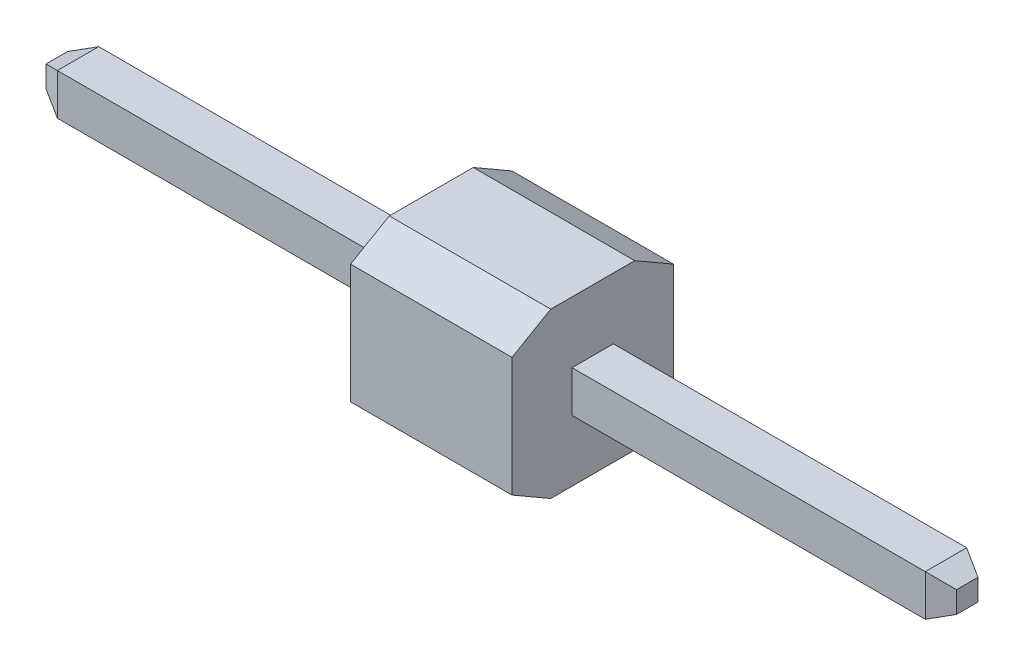
ISO-10303-21;
HEADER;
FILE_DESCRIPTION(('STEP AP214'),'2;1');
FILE_NAME('part.step','',(''),(''),'','','');
FILE_SCHEMA(('AUTOMOTIVE_DESIGN { 1 0 10303 214 1 1 1 1 }'));
ENDSEC;
DATA;
#1=APPLICATION_CONTEXT('core data for automotive mechanical design processes');
#2=APPLICATION_PROTOCOL_DEFINITION('international standard','automotive_design',2000,#1);
#3=PRODUCT_CONTEXT('',#1,'mechanical');
#4=PRODUCT('Part','Part','',(#3));
#5=PRODUCT_RELATED_PRODUCT_CATEGORY('part','',(#4));
#6=PRODUCT_DEFINITION_FORMATION('','',#4);
#7=PRODUCT_DEFINITION_CONTEXT('part definition',#1,'design');
#8=PRODUCT_DEFINITION('design','',#6,#7);
#9=PRODUCT_DEFINITION_SHAPE('','',#8);
#10=(LENGTH_UNIT() NAMED_UNIT(*) SI_UNIT(.MILLI.,.METRE.));
#11=(NAMED_UNIT(*) PLANE_ANGLE_UNIT() SI_UNIT($,.RADIAN.));
#12=(NAMED_UNIT(*) SI_UNIT($,.STERADIAN.) SOLID_ANGLE_UNIT());
#13=UNCERTAINTY_MEASURE_WITH_UNIT(LENGTH_MEASURE(1.E-05),#10,'distance_accuracy_value','');
#14=(GEOMETRIC_REPRESENTATION_CONTEXT(3) GLOBAL_UNCERTAINTY_ASSIGNED_CONTEXT((#13)) GLOBAL_UNIT_ASSIGNED_CONTEXT((#10,
#11,#12)) REPRESENTATION_CONTEXT('',''));
#15=CARTESIAN_POINT('',(0.,0.,0.));
#16=DIRECTION('',(0.,0.,1.));
#17=DIRECTION('',(1.,0.,0.));
#18=AXIS2_PLACEMENT_3D('',#15,#16,#17);
#19=CARTESIAN_POINT('',(5.42105059412149,-10.4771282629139,0.629998634255617));
#20=DIRECTION('',(1.,4.37113882867379E-08,-4.37113882867379E-08));
#21=DIRECTION('',(-4.37113882867379E-08,1.,0.));
#22=AXIS2_PLACEMENT_3D('',#19,#20,#21);
#23=PLANE('',#22);
#24=DIRECTION('',(1.59994777304463E-08,0.50000000000019,0.866025403784329));
#25=VECTOR('',#24,1.);
#26=CARTESIAN_POINT('',(5.42105047113557,-9.23353842442392,-0.940001365744382));
#27=LINE('',#26,#25);
#28=CARTESIAN_POINT('',(5.42105047113557,-9.23353842442392,-0.940001365744382));
#29=VERTEX_POINT('',#28);
#30=CARTESIAN_POINT('',(5.42105048222033,-8.88712826291392,-0.340001365744383));
#31=VERTEX_POINT('',#30);
#32=EDGE_CURVE('E11',#29,#31,#27,.T.);
#33=ORIENTED_EDGE('',*,*,#32,.T.);
#34=DIRECTION('',(4.37113886966664E-08,0.,0.999999999999999));
#35=VECTOR('',#34,1.);
#36=CARTESIAN_POINT('',(5.42105048222033,-8.88712826291392,-0.340001365744383));
#37=LINE('',#36,#35);
#38=CARTESIAN_POINT('',(5.42105053904514,-8.88712826291391,0.959998634255618));
#39=VERTEX_POINT('',#38);
#40=EDGE_CURVE('E304',#31,#39,#37,.T.);
#41=ORIENTED_EDGE('',*,*,#40,.T.);
#42=DIRECTION('',(5.97108668825761E-08,-0.500000000000186,0.86602540378433));
#43=VECTOR('',#42,1.);
#44=CARTESIAN_POINT('',(5.42105053904514,-8.88712826291391,0.959998634255618));
#45=LINE('',#44,#43);
#46=CARTESIAN_POINT('',(5.42105058041404,-9.23353842442391,1.55999863425562));
#47=VERTEX_POINT('',#46);
#48=EDGE_CURVE('E296',#39,#47,#45,.T.);
#49=ORIENTED_EDGE('',*,*,#48,.T.);
#50=DIRECTION('',(4.37113884815545E-08,-0.999999999999999,0.));
#51=VECTOR('',#50,1.);
#52=CARTESIAN_POINT('',(5.42105058041404,-9.23353842442391,1.55999863425562));
#53=LINE('',#52,#51);
#54=CARTESIAN_POINT('',(5.42105066115683,-11.0807181013939,1.55999863425562));
#55=VERTEX_POINT('',#54);
#56=EDGE_CURVE('E281',#47,#55,#53,.T.);
#57=ORIENTED_EDGE('',*,*,#56,.T.);
#58=DIRECTION('',(1.59994802942811E-08,0.500000000000192,0.866025403784328));
#59=VECTOR('',#58,1.);
#60=CARTESIAN_POINT('',(5.42105065007206,-11.4271282629139,0.959998634255618));
#61=LINE('',#60,#59);
#62=CARTESIAN_POINT('',(5.42105065007206,-11.4271282629139,0.959998634255618));
#63=VERTEX_POINT('',#62);
#64=EDGE_CURVE('E265',#63,#55,#61,.T.);
#65=ORIENTED_EDGE('',*,*,#64,.F.);
#66=DIRECTION('',(4.37113880134522E-08,0.,0.999999999999999));
#67=VECTOR('',#66,1.);
#68=CARTESIAN_POINT('',(5.42105059324726,-11.4271282629139,-0.340001365744383));
#69=LINE('',#68,#67);
#70=CARTESIAN_POINT('',(5.42105059324726,-11.4271282629139,-0.340001365744383));
#71=VERTEX_POINT('',#70);
#72=EDGE_CURVE('E248',#71,#63,#69,.T.);
#73=ORIENTED_EDGE('',*,*,#72,.F.);
#74=DIRECTION('',(5.97108656001701E-08,-0.500000000000187,0.866025403784328));
#75=VECTOR('',#74,1.);
#76=CARTESIAN_POINT('',(5.42105055187836,-11.0807181013939,-0.940001365744382));
#77=LINE('',#76,#75);
#78=CARTESIAN_POINT('',(5.42105055187836,-11.0807181013939,-0.940001365744382));
#79=VERTEX_POINT('',#78);
#80=EDGE_CURVE('E242',#79,#71,#77,.T.);
#81=ORIENTED_EDGE('',*,*,#80,.F.);
#82=DIRECTION('',(4.37113884815545E-08,-0.999999999999999,0.));
#83=VECTOR('',#82,1.);
#84=CARTESIAN_POINT('',(5.42105047113557,-9.23353842442392,-0.940001365744382));
#85=LINE('',#84,#83);
#86=EDGE_CURVE('E236',#29,#79,#85,.T.);
#87=ORIENTED_EDGE('',*,*,#86,.F.);
#88=EDGE_LOOP('',(#33,#41,#49,#57,#65,#73,#81,#87));
#89=FACE_BOUND('',#88,.T.);
#90=DIRECTION('',(-4.37113872875372E-08,0.,-0.999999999999999));
#91=VECTOR('',#90,1.);
#92=CARTESIAN_POINT('',(5.4210505661462,-9.83712826291391,0.629998634255617));
#93=LINE('',#92,#91);
#94=CARTESIAN_POINT('',(5.4210505661462,-9.83712826291391,0.629998634255617));
#95=VERTEX_POINT('',#94);
#96=CARTESIAN_POINT('',(5.42105053817091,-9.83712826291391,-0.0100013657443826));
#97=VERTEX_POINT('',#96);
#98=EDGE_CURVE('E302',#95,#97,#93,.T.);
#99=ORIENTED_EDGE('',*,*,#98,.T.);
#100=DIRECTION('',(-4.37113872875371E-08,0.999999999999999,0.));
#101=VECTOR('',#100,1.);
#102=CARTESIAN_POINT('',(5.4210505661462,-10.4771282629139,-0.0100013657443826));
#103=LINE('',#102,#101);
#104=CARTESIAN_POINT('',(5.4210505661462,-10.4771282629139,-0.0100013657443826));
#105=VERTEX_POINT('',#104);
#106=EDGE_CURVE('E293',#105,#97,#103,.T.);
#107=ORIENTED_EDGE('',*,*,#106,.F.);
#108=DIRECTION('',(-4.37113900630947E-08,0.,-0.999999999999999));
#109=VECTOR('',#108,1.);
#110=CARTESIAN_POINT('',(5.42105059412149,-10.4771282629139,0.629998634255617));
#111=LINE('',#110,#109);
#112=CARTESIAN_POINT('',(5.42105059412149,-10.4771282629139,0.629998634255617));
#113=VERTEX_POINT('',#112);
#114=EDGE_CURVE('E278',#113,#105,#111,.T.);
#115=ORIENTED_EDGE('',*,*,#114,.F.);
#116=DIRECTION('',(-4.37113900630947E-08,0.999999999999999,0.));
#117=VECTOR('',#116,1.);
#118=CARTESIAN_POINT('',(5.42105059412149,-10.4771282629139,0.629998634255617));
#119=LINE('',#118,#117);
#120=EDGE_CURVE('E263',#113,#95,#119,.T.);
#121=ORIENTED_EDGE('',*,*,#120,.T.);
#122=EDGE_LOOP('',(#99,#107,#115,#121));
#123=FACE_BOUND('',#122,.T.);
#124=ADVANCED_FACE('F17',(#89,#123),#23,.T.);
#125=CARTESIAN_POINT('',(2.92105059412149,-10.4771283721924,0.629998743534088));
#126=DIRECTION('',(1.,4.37113882867379E-08,-4.37113882867379E-08));
#127=DIRECTION('',(-4.37113882867379E-08,1.,0.));
#128=AXIS2_PLACEMENT_3D('',#125,#126,#127);
#129=PLANE('',#128);
#130=DIRECTION('',(1.59994783714339E-08,0.50000000000019,0.866025403784329));
#131=VECTOR('',#130,1.);
#132=CARTESIAN_POINT('',(2.92105047113557,-9.23353853370239,-0.940001256465912));
#133=LINE('',#132,#131);
#134=CARTESIAN_POINT('',(2.92105047113557,-9.23353853370239,-0.940001256465912));
#135=VERTEX_POINT('',#134);
#136=CARTESIAN_POINT('',(2.92105048222033,-8.88712837219239,-0.340001256465912));
#137=VERTEX_POINT('',#136);
#138=EDGE_CURVE('E24',#135,#137,#133,.T.);
#139=ORIENTED_EDGE('',*,*,#138,.F.);
#140=DIRECTION('',(4.37113882411397E-08,-0.999999999999999,0.));
#141=VECTOR('',#140,1.);
#142=CARTESIAN_POINT('',(2.92105047113557,-9.23353853370239,-0.940001256465912));
#143=LINE('',#142,#141);
#144=CARTESIAN_POINT('',(2.92105055187836,-11.0807182106724,-0.940001256465912));
#145=VERTEX_POINT('',#144);
#146=EDGE_CURVE('E300',#135,#145,#143,.T.);
#147=ORIENTED_EDGE('',*,*,#146,.T.);
#148=DIRECTION('',(5.97108668821452E-08,-0.500000000000187,0.866025403784328));
#149=VECTOR('',#148,1.);
#150=CARTESIAN_POINT('',(2.92105055187836,-11.0807182106724,-0.940001256465912));
#151=LINE('',#150,#149);
#152=CARTESIAN_POINT('',(2.92105059324726,-11.4271283721924,-0.340001256465912));
#153=VERTEX_POINT('',#152);
#154=EDGE_CURVE('E286',#145,#153,#151,.T.);
#155=ORIENTED_EDGE('',*,*,#154,.T.);
#156=DIRECTION('',(4.37113880134522E-08,0.,0.999999999999999));
#157=VECTOR('',#156,1.);
#158=CARTESIAN_POINT('',(2.92105059324726,-11.4271283721924,-0.340001256465912));
#159=LINE('',#158,#157);
#160=CARTESIAN_POINT('',(2.92105065007206,-11.4271283721924,0.959998743534088));
#161=VERTEX_POINT('',#160);
#162=EDGE_CURVE('E271',#153,#161,#159,.T.);
#163=ORIENTED_EDGE('',*,*,#162,.T.);
#164=DIRECTION('',(1.5999479012306E-08,0.500000000000192,0.866025403784328));
#165=VECTOR('',#164,1.);
#166=CARTESIAN_POINT('',(2.92105065007206,-11.4271283721924,0.959998743534088));
#167=LINE('',#166,#165);
#168=CARTESIAN_POINT('',(2.92105066115683,-11.0807182106724,1.55999874353409));
#169=VERTEX_POINT('',#168);
#170=EDGE_CURVE('E253',#161,#169,#167,.T.);
#171=ORIENTED_EDGE('',*,*,#170,.T.);
#172=DIRECTION('',(4.37113882411397E-08,-0.999999999999999,0.));
#173=VECTOR('',#172,1.);
#174=CARTESIAN_POINT('',(2.92105058041404,-9.23353853370238,1.55999874353409));
#175=LINE('',#174,#173);
#176=CARTESIAN_POINT('',(2.92105058041404,-9.23353853370238,1.55999874353409));
#177=VERTEX_POINT('',#176);
#178=EDGE_CURVE('E261',#177,#169,#175,.T.);
#179=ORIENTED_EDGE('',*,*,#178,.F.);
#180=DIRECTION('',(5.97108668825761E-08,-0.500000000000186,0.86602540378433));
#181=VECTOR('',#180,1.);
#182=CARTESIAN_POINT('',(2.92105053904514,-8.88712837219238,0.959998743534088));
#183=LINE('',#182,#181);
#184=CARTESIAN_POINT('',(2.92105053904514,-8.88712837219238,0.959998743534088));
#185=VERTEX_POINT('',#184);
#186=EDGE_CURVE('E276',#185,#177,#183,.T.);
#187=ORIENTED_EDGE('',*,*,#186,.F.);
#188=DIRECTION('',(4.37113883550593E-08,0.,0.999999999999999));
#189=VECTOR('',#188,1.);
#190=CARTESIAN_POINT('',(2.92105048222033,-8.88712837219239,-0.340001256465912));
#191=LINE('',#190,#189);
#192=EDGE_CURVE('E291',#137,#185,#191,.T.);
#193=ORIENTED_EDGE('',*,*,#192,.F.);
#194=EDGE_LOOP('',(#139,#147,#155,#163,#171,#179,#187,#193));
#195=FACE_BOUND('',#194,.T.);
#196=DIRECTION('',(-4.37113879814265E-08,0.999999999999999,0.));
#197=VECTOR('',#196,1.);
#198=CARTESIAN_POINT('',(2.9210505661462,-10.4771283721924,-0.0100012564659119));
#199=LINE('',#198,#197);
#200=CARTESIAN_POINT('',(2.9210505661462,-10.4771283721924,-0.0100012564659119));
#201=VERTEX_POINT('',#200);
#202=CARTESIAN_POINT('',(2.92105053817091,-9.83712837219238,-0.0100012564659119));
#203=VERTEX_POINT('',#202);
#204=EDGE_CURVE('E298',#201,#203,#199,.T.);
#205=ORIENTED_EDGE('',*,*,#204,.T.);
#206=DIRECTION('',(-4.37113879814266E-08,0.,-0.999999999999999));
#207=VECTOR('',#206,1.);
#208=CARTESIAN_POINT('',(2.9210505661462,-9.83712837219238,0.629998743534088));
#209=LINE('',#208,#207);
#210=CARTESIAN_POINT('',(2.9210505661462,-9.83712837219238,0.629998743534088));
#211=VERTEX_POINT('',#210);
#212=EDGE_CURVE('E283',#211,#203,#209,.T.);
#213=ORIENTED_EDGE('',*,*,#212,.F.);
#214=DIRECTION('',(-4.37113886753159E-08,0.999999999999999,0.));
#215=VECTOR('',#214,1.);
#216=CARTESIAN_POINT('',(2.92105059412149,-10.4771283721924,0.629998743534088));
#217=LINE('',#216,#215);
#218=CARTESIAN_POINT('',(2.92105059412149,-10.4771283721924,0.629998743534088));
#219=VERTEX_POINT('',#218);
#220=EDGE_CURVE('E268',#219,#211,#217,.T.);
#221=ORIENTED_EDGE('',*,*,#220,.F.);
#222=DIRECTION('',(-4.37113886753159E-08,0.,-0.999999999999999));
#223=VECTOR('',#222,1.);
#224=CARTESIAN_POINT('',(2.92105059412149,-10.4771283721924,0.629998743534088));
#225=LINE('',#224,#223);
#226=EDGE_CURVE('E251',#219,#201,#225,.T.);
#227=ORIENTED_EDGE('',*,*,#226,.T.);
#228=EDGE_LOOP('',(#205,#213,#221,#227));
#229=FACE_BOUND('',#228,.T.);
#230=ADVANCED_FACE('F314',(#195,#229),#129,.F.);
#231=CARTESIAN_POINT('',(5.42105047113557,-9.23353842442392,-0.940001365744382));
#232=DIRECTION('',(5.97108668343731E-08,-0.866025403784328,0.50000000000019));
#233=DIRECTION('',(-1.59994785476185E-08,-0.500000000000192,-0.866025403784329));
#234=AXIS2_PLACEMENT_3D('',#231,#232,#233);
#235=PLANE('',#234);
#236=ORIENTED_EDGE('',*,*,#138,.T.);
#237=DIRECTION('',(-0.999999999999998,-4.37113868656524E-08,4.37113883755557E-08));
#238=VECTOR('',#237,1.);
#239=CARTESIAN_POINT('',(5.42105048222033,-8.88712826291392,-0.340001365744383));
#240=LINE('',#239,#238);
#241=EDGE_CURVE('E288',#31,#137,#240,.T.);
#242=ORIENTED_EDGE('',*,*,#241,.F.);
#243=ORIENTED_EDGE('',*,*,#32,.F.);
#244=DIRECTION('',(-0.999999999999998,-4.37113897078233E-08,4.37113881091022E-08));
#245=VECTOR('',#244,1.);
#246=CARTESIAN_POINT('',(5.42105047113557,-9.23353842442392,-0.940001365744382));
#247=LINE('',#246,#245);
#248=EDGE_CURVE('E256',#29,#135,#247,.T.);
#249=ORIENTED_EDGE('',*,*,#248,.T.);
#250=EDGE_LOOP('',(#236,#242,#243,#249));
#251=FACE_BOUND('',#250,.T.);
#252=ADVANCED_FACE('F306',(#251),#235,.F.);
#253=CARTESIAN_POINT('',(5.42105048222033,-8.88712826291392,-0.340001365744383));
#254=DIRECTION('',(4.37113882867379E-08,-1.,0.));
#255=DIRECTION('',(1.,4.37113882867379E-08,-4.37113882867379E-08));
#256=AXIS2_PLACEMENT_3D('',#253,#254,#255);
#257=PLANE('',#256);
#258=ORIENTED_EDGE('',*,*,#192,.T.);
#259=DIRECTION('',(-0.999999999999998,-4.37113868656524E-08,4.37113882867378E-08));
#260=VECTOR('',#259,1.);
#261=CARTESIAN_POINT('',(5.42105053904514,-8.88712826291391,0.959998634255618));
#262=LINE('',#261,#260);
#263=EDGE_CURVE('E273',#39,#185,#262,.T.);
#264=ORIENTED_EDGE('',*,*,#263,.F.);
#265=ORIENTED_EDGE('',*,*,#40,.F.);
#266=ORIENTED_EDGE('',*,*,#241,.T.);
#267=EDGE_LOOP('',(#258,#264,#265,#266));
#268=FACE_BOUND('',#267,.T.);
#269=ADVANCED_FACE('F311',(#268),#257,.F.);
#270=CARTESIAN_POINT('',(5.42105053904514,-8.88712826291391,0.959998634255618));
#271=DIRECTION('',(1.59994785476185E-08,-0.86602540378433,-0.50000000000019));
#272=DIRECTION('',(-5.97108668343731E-08,0.500000000000188,-0.866025403784329));
#273=AXIS2_PLACEMENT_3D('',#270,#271,#272);
#274=PLANE('',#273);
#275=ORIENTED_EDGE('',*,*,#186,.T.);
#276=DIRECTION('',(-0.999999999999998,-4.37113897078233E-08,4.37113882867378E-08));
#277=VECTOR('',#276,1.);
#278=CARTESIAN_POINT('',(5.42105058041404,-9.23353842442391,1.55999863425562));
#279=LINE('',#278,#277);
#280=EDGE_CURVE('E258',#47,#177,#279,.T.);
#281=ORIENTED_EDGE('',*,*,#280,.F.);
#282=ORIENTED_EDGE('',*,*,#48,.F.);
#283=ORIENTED_EDGE('',*,*,#263,.T.);
#284=EDGE_LOOP('',(#275,#281,#282,#283));
#285=FACE_BOUND('',#284,.T.);
#286=ADVANCED_FACE('F319',(#285),#274,.F.);
#287=CARTESIAN_POINT('',(5.42105058041404,-9.23353842442391,1.55999863425562));
#288=DIRECTION('',(-4.37113882867379E-08,0.,-1.));
#289=DIRECTION('',(-1.,-4.37113882867379E-08,4.37113882867379E-08));
#290=AXIS2_PLACEMENT_3D('',#287,#288,#289);
#291=PLANE('',#290);
#292=ORIENTED_EDGE('',*,*,#178,.T.);
#293=DIRECTION('',(-0.999999999999998,-4.37113897078233E-08,4.37113882867378E-08));
#294=VECTOR('',#293,1.);
#295=CARTESIAN_POINT('',(5.42105066115683,-11.0807181013939,1.55999863425562));
#296=LINE('',#295,#294);
#297=EDGE_CURVE('E245',#55,#169,#296,.T.);
#298=ORIENTED_EDGE('',*,*,#297,.F.);
#299=ORIENTED_EDGE('',*,*,#56,.F.);
#300=ORIENTED_EDGE('',*,*,#280,.T.);
#301=EDGE_LOOP('',(#292,#298,#299,#300));
#302=FACE_BOUND('',#301,.T.);
#303=ADVANCED_FACE('F326',(#302),#291,.F.);
#304=CARTESIAN_POINT('',(5.42105065007206,-11.4271282629139,0.959998634255618));
#305=DIRECTION('',(5.97108668343731E-08,-0.866025403784328,0.50000000000019));
#306=DIRECTION('',(-1.59994785476185E-08,-0.500000000000192,-0.866025403784329));
#307=AXIS2_PLACEMENT_3D('',#304,#305,#306);
#308=PLANE('',#307);
#309=ORIENTED_EDGE('',*,*,#170,.F.);
#310=DIRECTION('',(-0.999999999999998,-4.37113897078233E-08,4.37113882867378E-08));
#311=VECTOR('',#310,1.);
#312=CARTESIAN_POINT('',(5.42105065007206,-11.4271282629139,0.959998634255618));
#313=LINE('',#312,#311);
#314=EDGE_CURVE('E239',#63,#161,#313,.T.);
#315=ORIENTED_EDGE('',*,*,#314,.F.);
#316=ORIENTED_EDGE('',*,*,#64,.T.);
#317=ORIENTED_EDGE('',*,*,#297,.T.);
#318=EDGE_LOOP('',(#309,#315,#316,#317));
#319=FACE_BOUND('',#318,.T.);
#320=ADVANCED_FACE('F329',(#319),#308,.T.);
#321=CARTESIAN_POINT('',(5.42105059324726,-11.4271282629139,-0.340001365744383));
#322=DIRECTION('',(4.37113882867379E-08,-1.,0.));
#323=DIRECTION('',(1.,4.37113882867379E-08,-4.37113882867379E-08));
#324=AXIS2_PLACEMENT_3D('',#321,#322,#323);
#325=PLANE('',#324);
#326=ORIENTED_EDGE('',*,*,#162,.F.);
#327=DIRECTION('',(-0.999999999999998,-4.37113897078233E-08,4.37113883755557E-08));
#328=VECTOR('',#327,1.);
#329=CARTESIAN_POINT('',(5.42105059324726,-11.4271282629139,-0.340001365744383));
#330=LINE('',#329,#328);
#331=EDGE_CURVE('E233',#71,#153,#330,.T.);
#332=ORIENTED_EDGE('',*,*,#331,.F.);
#333=ORIENTED_EDGE('',*,*,#72,.T.);
#334=ORIENTED_EDGE('',*,*,#314,.T.);
#335=EDGE_LOOP('',(#326,#332,#333,#334));
#336=FACE_BOUND('',#335,.T.);
#337=ADVANCED_FACE('F333',(#336),#325,.T.);
#338=CARTESIAN_POINT('',(5.42105055187836,-11.0807181013939,-0.940001365744382));
#339=DIRECTION('',(1.59994785476185E-08,-0.86602540378433,-0.50000000000019));
#340=DIRECTION('',(-5.97108668343731E-08,0.500000000000188,-0.866025403784329));
#341=AXIS2_PLACEMENT_3D('',#338,#339,#340);
#342=PLANE('',#341);
#343=ORIENTED_EDGE('',*,*,#154,.F.);
#344=DIRECTION('',(-0.999999999999998,-4.37113897078233E-08,4.37113881091021E-08));
#345=VECTOR('',#344,1.);
#346=CARTESIAN_POINT('',(5.42105055187836,-11.0807181013939,-0.940001365744382));
#347=LINE('',#346,#345);
#348=EDGE_CURVE('E230',#79,#145,#347,.T.);
#349=ORIENTED_EDGE('',*,*,#348,.F.);
#350=ORIENTED_EDGE('',*,*,#80,.T.);
#351=ORIENTED_EDGE('',*,*,#331,.T.);
#352=EDGE_LOOP('',(#343,#349,#350,#351));
#353=FACE_BOUND('',#352,.T.);
#354=ADVANCED_FACE('F337',(#353),#342,.T.);
#355=CARTESIAN_POINT('',(5.42105047113557,-9.23353842442392,-0.940001365744382));
#356=DIRECTION('',(-4.37113882867379E-08,0.,-1.));
#357=DIRECTION('',(-4.37113882867379E-08,1.,0.));
#358=AXIS2_PLACEMENT_3D('',#355,#356,#357);
#359=PLANE('',#358);
#360=ORIENTED_EDGE('',*,*,#146,.F.);
#361=ORIENTED_EDGE('',*,*,#248,.F.);
#362=ORIENTED_EDGE('',*,*,#86,.T.);
#363=ORIENTED_EDGE('',*,*,#348,.T.);
#364=EDGE_LOOP('',(#360,#361,#362,#363));
#365=FACE_BOUND('',#364,.T.);
#366=ADVANCED_FACE('F339',(#365),#359,.T.);
#367=CARTESIAN_POINT('',(-2.87894940587851,-10.4771286257184,0.62999899706014));
#368=DIRECTION('',(-1.,-4.37113882867379E-08,4.37113882867379E-08));
#369=DIRECTION('',(4.37113882867379E-08,-1.,0.));
#370=AXIS2_PLACEMENT_3D('',#367,#368,#369);
#371=PLANE('',#370);
#372=DIRECTION('',(4.37113927490808E-08,-0.999999999999999,0.));
#373=VECTOR('',#372,1.);
#374=CARTESIAN_POINT('',(-2.87894944837634,-9.99101015290844,0.14388052425114));
#375=LINE('',#374,#373);
#376=CARTESIAN_POINT('',(-2.87894944837634,-9.99101015290844,0.14388052425114));
#377=VERTEX_POINT('',#376);
#378=CARTESIAN_POINT('',(-2.8789494338538,-10.3232470985184,0.14388052425114));
#379=VERTEX_POINT('',#378);
#380=EDGE_CURVE('E228',#377,#379,#375,.T.);
#381=ORIENTED_EDGE('',*,*,#380,.T.);
#382=DIRECTION('',(4.37113874013716E-08,0.,0.999999999999999));
#383=VECTOR('',#382,1.);
#384=CARTESIAN_POINT('',(-2.8789494338538,-10.3232470985184,0.14388052425114));
#385=LINE('',#384,#383);
#386=CARTESIAN_POINT('',(-2.87894941933126,-10.3232470985184,0.47611746986914));
#387=VERTEX_POINT('',#386);
#388=EDGE_CURVE('E223',#379,#387,#385,.T.);
#389=ORIENTED_EDGE('',*,*,#388,.T.);
#390=DIRECTION('',(-4.37113900757526E-08,0.999999999999999,0.));
#391=VECTOR('',#390,1.);
#392=CARTESIAN_POINT('',(-2.87894941933126,-10.3232470985184,0.47611746986914));
#393=LINE('',#392,#391);
#394=CARTESIAN_POINT('',(-2.8789494338538,-9.99101015290844,0.47611746986914));
#395=VERTEX_POINT('',#394);
#396=EDGE_CURVE('E215',#387,#395,#393,.T.);
#397=ORIENTED_EDGE('',*,*,#396,.T.);
#398=DIRECTION('',(-4.37113847280434E-08,0.,-0.999999999999999));
#399=VECTOR('',#398,1.);
#400=CARTESIAN_POINT('',(-2.8789494338538,-9.99101015290844,0.47611746986914));
#401=LINE('',#400,#399);
#402=EDGE_CURVE('E207',#395,#377,#401,.T.);
#403=ORIENTED_EDGE('',*,*,#402,.T.);
#404=EDGE_LOOP('',(#381,#389,#397,#403));
#405=FACE_BOUND('',#404,.T.);
#406=ADVANCED_FACE('F341',(#405),#371,.T.);
#407=CARTESIAN_POINT('',(-2.87894940587851,-10.4771286257184,0.62999899706014));
#408=DIRECTION('',(4.37113882867379E-08,-1.,0.));
#409=DIRECTION('',(-4.37113882867379E-08,0.,-1.));
#410=AXIS2_PLACEMENT_3D('',#407,#408,#409);
#411=PLANE('',#410);
#412=DIRECTION('',(0.999999999999998,4.37113881958092E-08,-4.37113882769955E-08));
#413=VECTOR('',#412,1.);
#414=CARTESIAN_POINT('',(-2.54894940587851,-10.4771286112937,0.629998982635382));
#415=LINE('',#414,#413);
#416=CARTESIAN_POINT('',(-2.54894940587851,-10.4771286112937,0.629998982635382));
#417=VERTEX_POINT('',#416);
#418=EDGE_CURVE('E225',#417,#219,#415,.T.);
#419=ORIENTED_EDGE('',*,*,#418,.F.);
#420=DIRECTION('',(-4.37113872875372E-08,0.,-0.999999999999999));
#421=VECTOR('',#420,1.);
#422=CARTESIAN_POINT('',(-2.54894940587851,-10.4771286112937,0.629998982635382));
#423=LINE('',#422,#421);
#424=CARTESIAN_POINT('',(-2.5489494338538,-10.4771286112937,-0.010001017364618));
#425=VERTEX_POINT('',#424);
#426=EDGE_CURVE('E217',#417,#425,#423,.T.);
#427=ORIENTED_EDGE('',*,*,#426,.T.);
#428=DIRECTION('',(0.999999999999998,4.37113881958092E-08,-4.37113882161058E-08));
#429=VECTOR('',#428,1.);
#430=CARTESIAN_POINT('',(-2.5489494338538,-10.4771286112937,-0.010001017364618));
#431=LINE('',#430,#429);
#432=EDGE_CURVE('E220',#425,#201,#431,.T.);
#433=ORIENTED_EDGE('',*,*,#432,.T.);
#434=ORIENTED_EDGE('',*,*,#226,.F.);
#435=EDGE_LOOP('',(#419,#427,#433,#434));
#436=FACE_BOUND('',#435,.T.);
#437=ADVANCED_FACE('F348',(#436),#411,.T.);
#438=CARTESIAN_POINT('',(-2.8789494338538,-10.4771286257184,-0.0100010029398598));
#439=DIRECTION('',(-4.37113882867379E-08,0.,-1.));
#440=DIRECTION('',(-1.,-4.37113882867379E-08,4.37113882867379E-08));
#441=AXIS2_PLACEMENT_3D('',#438,#439,#440);
#442=PLANE('',#441);
#443=ORIENTED_EDGE('',*,*,#432,.F.);
#444=DIRECTION('',(-4.37113886753159E-08,0.999999999999999,0.));
#445=VECTOR('',#444,1.);
#446=CARTESIAN_POINT('',(-2.5489494338538,-10.4771286112937,-0.010001017364618));
#447=LINE('',#446,#445);
#448=CARTESIAN_POINT('',(-2.54894946182909,-9.83712861129368,-0.010001017364618));
#449=VERTEX_POINT('',#448);
#450=EDGE_CURVE('E209',#425,#449,#447,.T.);
#451=ORIENTED_EDGE('',*,*,#450,.T.);
#452=DIRECTION('',(0.999999999999998,4.37113907937716E-08,-4.37113882161057E-08));
#453=VECTOR('',#452,1.);
#454=CARTESIAN_POINT('',(-2.54894946182909,-9.83712861129368,-0.010001017364618));
#455=LINE('',#454,#453);
#456=EDGE_CURVE('E212',#449,#203,#455,.T.);
#457=ORIENTED_EDGE('',*,*,#456,.T.);
#458=ORIENTED_EDGE('',*,*,#204,.F.);
#459=EDGE_LOOP('',(#443,#451,#457,#458));
#460=FACE_BOUND('',#459,.T.);
#461=ADVANCED_FACE('F424',(#460),#442,.T.);
#462=CARTESIAN_POINT('',(-2.8789494338538,-9.83712862571844,0.62999899706014));
#463=DIRECTION('',(4.37113882867379E-08,-1.,0.));
#464=DIRECTION('',(-4.37113882867379E-08,0.,-1.));
#465=AXIS2_PLACEMENT_3D('',#462,#463,#464);
#466=PLANE('',#465);
#467=ORIENTED_EDGE('',*,*,#456,.F.);
#468=DIRECTION('',(4.37113900630947E-08,0.,0.999999999999999));
#469=VECTOR('',#468,1.);
#470=CARTESIAN_POINT('',(-2.54894946182909,-9.83712861129368,-0.010001017364618));
#471=LINE('',#470,#469);
#472=CARTESIAN_POINT('',(-2.5489494338538,-9.83712861129368,0.629998982635382));
#473=VERTEX_POINT('',#472);
#474=EDGE_CURVE('E201',#449,#473,#471,.T.);
#475=ORIENTED_EDGE('',*,*,#474,.T.);
#476=DIRECTION('',(0.999999999999998,4.37113907937716E-08,-4.37113882769955E-08));
#477=VECTOR('',#476,1.);
#478=CARTESIAN_POINT('',(-2.5489494338538,-9.83712861129368,0.629998982635382));
#479=LINE('',#478,#477);
#480=EDGE_CURVE('E204',#473,#211,#479,.T.);
#481=ORIENTED_EDGE('',*,*,#480,.T.);
#482=ORIENTED_EDGE('',*,*,#212,.T.);
#483=EDGE_LOOP('',(#467,#475,#481,#482));
#484=FACE_BOUND('',#483,.T.);
#485=ADVANCED_FACE('F421',(#484),#466,.F.);
#486=CARTESIAN_POINT('',(-2.87894940587851,-10.4771286257184,0.62999899706014));
#487=DIRECTION('',(-4.37113882867379E-08,0.,-1.));
#488=DIRECTION('',(-1.,-4.37113882867379E-08,4.37113882867379E-08));
#489=AXIS2_PLACEMENT_3D('',#486,#487,#488);
#490=PLANE('',#489);
#491=ORIENTED_EDGE('',*,*,#480,.F.);
#492=DIRECTION('',(4.37113858997586E-08,-0.999999999999999,0.));
#493=VECTOR('',#492,1.);
#494=CARTESIAN_POINT('',(-2.5489494338538,-9.83712861129368,0.629998982635382));
#495=LINE('',#494,#493);
#496=EDGE_CURVE('E196',#473,#417,#495,.T.);
#497=ORIENTED_EDGE('',*,*,#496,.T.);
#498=ORIENTED_EDGE('',*,*,#418,.T.);
#499=ORIENTED_EDGE('',*,*,#220,.T.);
#500=EDGE_LOOP('',(#491,#497,#498,#499));
#501=FACE_BOUND('',#500,.T.);
#502=ADVANCED_FACE('F376',(#501),#490,.F.);
#503=CARTESIAN_POINT('',(-2.87894940587851,-10.4771286257184,0.62999899706014));
#504=DIRECTION('',(-4.37113882867379E-08,0.,-1.));
#505=DIRECTION('',(-1.,-4.37113882867379E-08,4.37113882867379E-08));
#506=AXIS2_PLACEMENT_3D('',#503,#504,#505);
#507=PLANE('',#506);
#508=DIRECTION('',(0.999999999999998,4.37113829998842E-08,-4.37113882769955E-08));
#509=VECTOR('',#508,1.);
#510=CARTESIAN_POINT('',(5.42105059412149,-10.4771282629139,0.629998634255617));
#511=LINE('',#510,#509);
#512=CARTESIAN_POINT('',(10.8910505941215,-10.4771280238126,0.629998395154324));
#513=VERTEX_POINT('',#512);
#514=EDGE_CURVE('E199',#113,#513,#511,.T.);
#515=ORIENTED_EDGE('',*,*,#514,.T.);
#516=DIRECTION('',(-4.37113872875371E-08,0.999999999999999,0.));
#517=VECTOR('',#516,1.);
#518=CARTESIAN_POINT('',(10.8910505941215,-10.4771280238126,0.629998395154324));
#519=LINE('',#518,#517);
#520=CARTESIAN_POINT('',(10.8910505661462,-9.83712802381262,0.629998395154324));
#521=VERTEX_POINT('',#520);
#522=EDGE_CURVE('E191',#513,#521,#519,.T.);
#523=ORIENTED_EDGE('',*,*,#522,.T.);
#524=DIRECTION('',(0.999999999999998,4.37113933917341E-08,-4.37113882769955E-08));
#525=VECTOR('',#524,1.);
#526=CARTESIAN_POINT('',(5.4210505661462,-9.83712826291391,0.629998634255617));
#527=LINE('',#526,#525);
#528=EDGE_CURVE('E194',#95,#521,#527,.T.);
#529=ORIENTED_EDGE('',*,*,#528,.F.);
#530=ORIENTED_EDGE('',*,*,#120,.F.);
#531=EDGE_LOOP('',(#515,#523,#529,#530));
#532=FACE_BOUND('',#531,.T.);
#533=ADVANCED_FACE('F367',(#532),#507,.F.);
#534=CARTESIAN_POINT('',(-2.8789494338538,-9.83712862571844,0.62999899706014));
#535=DIRECTION('',(4.37113882867379E-08,-1.,0.));
#536=DIRECTION('',(-4.37113882867379E-08,0.,-1.));
#537=AXIS2_PLACEMENT_3D('',#534,#535,#536);
#538=PLANE('',#537);
#539=ORIENTED_EDGE('',*,*,#528,.T.);
#540=DIRECTION('',(-4.37113900630947E-08,0.,-0.999999999999999));
#541=VECTOR('',#540,1.);
#542=CARTESIAN_POINT('',(10.8910505661462,-9.83712802381262,0.629998395154324));
#543=LINE('',#542,#541);
#544=CARTESIAN_POINT('',(10.8910505381709,-9.83712802381262,-0.0100016048456765));
#545=VERTEX_POINT('',#544);
#546=EDGE_CURVE('E186',#521,#545,#543,.T.);
#547=ORIENTED_EDGE('',*,*,#546,.T.);
#548=DIRECTION('',(0.999999999999998,4.37113933917341E-08,-4.37113881146228E-08));
#549=VECTOR('',#548,1.);
#550=CARTESIAN_POINT('',(5.42105053817091,-9.83712826291391,-0.0100013657443823));
#551=LINE('',#550,#549);
#552=EDGE_CURVE('E189',#97,#545,#551,.T.);
#553=ORIENTED_EDGE('',*,*,#552,.F.);
#554=ORIENTED_EDGE('',*,*,#98,.F.);
#555=EDGE_LOOP('',(#539,#547,#553,#554));
#556=FACE_BOUND('',#555,.T.);
#557=ADVANCED_FACE('F364',(#556),#538,.F.);
#558=CARTESIAN_POINT('',(-2.8789494338538,-10.4771286257184,-0.0100010029398598));
#559=DIRECTION('',(-4.37113882867379E-08,0.,-1.));
#560=DIRECTION('',(-1.,-4.37113882867379E-08,4.37113882867379E-08));
#561=AXIS2_PLACEMENT_3D('',#558,#559,#560);
#562=PLANE('',#561);
#563=ORIENTED_EDGE('',*,*,#552,.T.);
#564=DIRECTION('',(4.37113900630949E-08,-0.999999999999999,0.));
#565=VECTOR('',#564,1.);
#566=CARTESIAN_POINT('',(10.8910505381709,-9.83712802381262,-0.0100016048456764));
#567=LINE('',#566,#565);
#568=CARTESIAN_POINT('',(10.8910505661462,-10.4771280238126,-0.0100016048456765));
#569=VERTEX_POINT('',#568);
#570=EDGE_CURVE('E176',#545,#569,#567,.T.);
#571=ORIENTED_EDGE('',*,*,#570,.T.);
#572=DIRECTION('',(0.999999999999998,4.37113829998842E-08,-4.37113881146228E-08));
#573=VECTOR('',#572,1.);
#574=CARTESIAN_POINT('',(5.4210505661462,-10.4771282629139,-0.0100013657443823));
#575=LINE('',#574,#573);
#576=EDGE_CURVE('E179',#105,#569,#575,.T.);
#577=ORIENTED_EDGE('',*,*,#576,.F.);
#578=ORIENTED_EDGE('',*,*,#106,.T.);
#579=EDGE_LOOP('',(#563,#571,#577,#578));
#580=FACE_BOUND('',#579,.T.);
#581=ADVANCED_FACE('F366',(#580),#562,.T.);
#582=CARTESIAN_POINT('',(-2.87894940587851,-10.4771286257184,0.62999899706014));
#583=DIRECTION('',(4.37113882867379E-08,-1.,0.));
#584=DIRECTION('',(-4.37113882867379E-08,0.,-1.));
#585=AXIS2_PLACEMENT_3D('',#582,#583,#584);
#586=PLANE('',#585);
#587=ORIENTED_EDGE('',*,*,#576,.T.);
#588=DIRECTION('',(4.37113872875372E-08,0.,0.999999999999999));
#589=VECTOR('',#588,1.);
#590=CARTESIAN_POINT('',(10.8910505661462,-10.4771280238126,-0.0100016048456765));
#591=LINE('',#590,#589);
#592=EDGE_CURVE('E167',#569,#513,#591,.T.);
#593=ORIENTED_EDGE('',*,*,#592,.T.);
#594=ORIENTED_EDGE('',*,*,#514,.F.);
#595=ORIENTED_EDGE('',*,*,#114,.T.);
#596=EDGE_LOOP('',(#587,#593,#594,#595));
#597=FACE_BOUND('',#596,.T.);
#598=ADVANCED_FACE('F373',(#597),#586,.T.);
#599=CARTESIAN_POINT('',(11.2210505941215,-10.4771280093879,0.629998380729565));
#600=DIRECTION('',(-1.,-4.37113882867379E-08,4.37113882867379E-08));
#601=DIRECTION('',(4.37113882867379E-08,-1.,0.));
#602=AXIS2_PLACEMENT_3D('',#599,#600,#601);
#603=PLANE('',#602);
#604=DIRECTION('',(-4.37113874024243E-08,0.999999999999999,0.));
#605=VECTOR('',#604,1.);
#606=CARTESIAN_POINT('',(11.2210505661462,-10.3232464821879,0.143879907920565));
#607=LINE('',#606,#605);
#608=CARTESIAN_POINT('',(11.2210505661462,-10.3232464821879,0.143879907920565));
#609=VERTEX_POINT('',#608);
#610=CARTESIAN_POINT('',(11.2210505516237,-9.99100953657786,0.143879907920565));
#611=VERTEX_POINT('',#610);
#612=EDGE_CURVE('E153',#609,#611,#607,.T.);
#613=ORIENTED_EDGE('',*,*,#612,.T.);
#614=DIRECTION('',(4.37113874013716E-08,0.,0.999999999999999));
#615=VECTOR('',#614,1.);
#616=CARTESIAN_POINT('',(11.2210505516237,-9.99100953657787,0.143879907920565));
#617=LINE('',#616,#615);
#618=CARTESIAN_POINT('',(11.2210505661462,-9.99100953657786,0.476116853538565));
#619=VERTEX_POINT('',#618);
#620=EDGE_CURVE('E395',#611,#619,#617,.T.);
#621=ORIENTED_EDGE('',*,*,#620,.T.);
#622=DIRECTION('',(4.37113874024243E-08,-0.999999999999999,0.));
#623=VECTOR('',#622,1.);
#624=CARTESIAN_POINT('',(11.2210505661462,-9.99100953657786,0.476116853538565));
#625=LINE('',#624,#623);
#626=CARTESIAN_POINT('',(11.2210505806687,-10.3232464821879,0.476116853538565));
#627=VERTEX_POINT('',#626);
#628=EDGE_CURVE('E156',#619,#627,#625,.T.);
#629=ORIENTED_EDGE('',*,*,#628,.T.);
#630=DIRECTION('',(-4.37113927480282E-08,0.,-0.999999999999999));
#631=VECTOR('',#630,1.);
#632=CARTESIAN_POINT('',(11.2210505806687,-10.3232464821879,0.476116853538565));
#633=LINE('',#632,#631);
#634=EDGE_CURVE('E149',#627,#609,#633,.T.);
#635=ORIENTED_EDGE('',*,*,#634,.T.);
#636=EDGE_LOOP('',(#613,#621,#629,#635));
#637=FACE_BOUND('',#636,.T.);
#638=ADVANCED_FACE('F151',(#637),#603,.F.);
#639=CARTESIAN_POINT('',(-2.87894942712743,-9.99101015290844,0.62999899706014));
#640=DIRECTION('',(-0.422618301356784,0.906307768563367,1.84732310895534E-08));
#641=DIRECTION('',(4.37113882867379E-08,0.,1.));
#642=AXIS2_PLACEMENT_3D('',#639,#640,#641);
#643=PLANE('',#642);
#644=DIRECTION('',(0.834817095446925,0.38928165712602,-0.389281657126018));
#645=VECTOR('',#644,1.);
#646=CARTESIAN_POINT('',(-2.87894944837636,-9.99101015290792,0.143880524251623));
#647=LINE('',#646,#645);
#648=EDGE_CURVE('E181',#377,#449,#647,.T.);
#649=ORIENTED_EDGE('',*,*,#648,.F.);
#650=ORIENTED_EDGE('',*,*,#402,.F.);
#651=DIRECTION('',(-0.834817129479007,-0.389281657126019,-0.389281584143986));
#652=VECTOR('',#651,1.);
#653=CARTESIAN_POINT('',(-2.54894943385423,-9.83712861129221,0.629998982634844));
#654=LINE('',#653,#652);
#655=EDGE_CURVE('E404',#473,#395,#654,.T.);
#656=ORIENTED_EDGE('',*,*,#655,.F.);
#657=ORIENTED_EDGE('',*,*,#474,.F.);
#658=EDGE_LOOP('',(#649,#650,#656,#657));
#659=FACE_BOUND('',#658,.T.);
#660=ADVANCED_FACE('F418',(#659),#643,.T.);
#661=CARTESIAN_POINT('',(-2.87894941260489,-10.4771286257184,0.47611746986914));
#662=DIRECTION('',(-0.422618222124841,-1.84732292043498E-08,0.906307805509828));
#663=DIRECTION('',(4.37113882867379E-08,-1.,0.));
#664=AXIS2_PLACEMENT_3D('',#661,#662,#663);
#665=PLANE('',#664);
#666=ORIENTED_EDGE('',*,*,#655,.T.);
#667=ORIENTED_EDGE('',*,*,#396,.F.);
#668=DIRECTION('',(-0.834817163511087,0.389281584143985,-0.389281584143987));
#669=VECTOR('',#668,1.);
#670=CARTESIAN_POINT('',(-2.54894940587737,-10.4771286112909,0.629998982635654));
#671=LINE('',#670,#669);
#672=EDGE_CURVE('E160',#417,#387,#671,.T.);
#673=ORIENTED_EDGE('',*,*,#672,.F.);
#674=ORIENTED_EDGE('',*,*,#496,.F.);
#675=EDGE_LOOP('',(#666,#667,#673,#674));
#676=FACE_BOUND('',#675,.T.);
#677=ADVANCED_FACE('F434',(#676),#665,.T.);
#678=CARTESIAN_POINT('',(-2.5489494338538,-10.4771286112937,-0.010001017364618));
#679=DIRECTION('',(0.422618301356784,1.8473232667688E-08,0.906307768563367));
#680=DIRECTION('',(-4.37113882867379E-08,1.,0.));
#681=AXIS2_PLACEMENT_3D('',#678,#679,#680);
#682=PLANE('',#681);
#683=ORIENTED_EDGE('',*,*,#648,.T.);
#684=ORIENTED_EDGE('',*,*,#450,.F.);
#685=DIRECTION('',(0.834817129479008,-0.389281584143985,-0.389281657126018));
#686=VECTOR('',#685,1.);
#687=CARTESIAN_POINT('',(-2.87894943385664,-10.323247098526,0.1438805242526));
#688=LINE('',#687,#686);
#689=EDGE_CURVE('E170',#379,#425,#688,.T.);
#690=ORIENTED_EDGE('',*,*,#689,.F.);
#691=ORIENTED_EDGE('',*,*,#380,.F.);
#692=EDGE_LOOP('',(#683,#684,#690,#691));
#693=FACE_BOUND('',#692,.T.);
#694=ADVANCED_FACE('F413',(#693),#682,.F.);
#695=CARTESIAN_POINT('',(-2.54894940587851,-10.4771286112937,0.629998982635382));
#696=DIRECTION('',(0.422618222124841,0.906307805509828,-1.84732308250282E-08));
#697=DIRECTION('',(-4.37113882867379E-08,0.,-1.));
#698=AXIS2_PLACEMENT_3D('',#695,#696,#697);
#699=PLANE('',#698);
#700=ORIENTED_EDGE('',*,*,#672,.T.);
#701=ORIENTED_EDGE('',*,*,#388,.F.);
#702=ORIENTED_EDGE('',*,*,#689,.T.);
#703=ORIENTED_EDGE('',*,*,#426,.F.);
#704=EDGE_LOOP('',(#700,#701,#702,#703));
#705=FACE_BOUND('',#704,.T.);
#706=ADVANCED_FACE('F429',(#705),#699,.F.);
#707=CARTESIAN_POINT('',(11.2210505873951,-10.3232464821879,0.629998380729565));
#708=DIRECTION('',(0.422618301356784,-0.906307768563367,-1.84732310470096E-08));
#709=DIRECTION('',(4.37113882867379E-08,0.,1.));
#710=AXIS2_PLACEMENT_3D('',#707,#708,#709);
#711=PLANE('',#710);
#712=DIRECTION('',(-0.834817129479003,-0.389281657126027,-0.389281584143988));
#713=VECTOR('',#712,1.);
#714=CARTESIAN_POINT('',(11.2210505661462,-10.3232464821884,0.143879907921048));
#715=LINE('',#714,#713);
#716=EDGE_CURVE('E164',#609,#569,#715,.T.);
#717=ORIENTED_EDGE('',*,*,#716,.F.);
#718=ORIENTED_EDGE('',*,*,#634,.F.);
#719=DIRECTION('',(0.834817095446923,0.389281657126025,-0.389281657126018));
#720=VECTOR('',#719,1.);
#721=CARTESIAN_POINT('',(10.8910505941215,-10.4771280238126,0.629998395154324));
#722=LINE('',#721,#720);
#723=EDGE_CURVE('E392',#513,#627,#722,.T.);
#724=ORIENTED_EDGE('',*,*,#723,.F.);
#725=ORIENTED_EDGE('',*,*,#592,.F.);
#726=EDGE_LOOP('',(#717,#718,#724,#725));
#727=FACE_BOUND('',#726,.T.);
#728=ADVANCED_FACE('F165',(#727),#711,.T.);
#729=CARTESIAN_POINT('',(10.8910505941215,-10.4771280238126,0.629998395154324));
#730=DIRECTION('',(-0.422618301356784,-1.8473232667688E-08,-0.906307768563367));
#731=DIRECTION('',(-4.37113882867379E-08,1.,0.));
#732=AXIS2_PLACEMENT_3D('',#729,#730,#731);
#733=PLANE('',#732);
#734=ORIENTED_EDGE('',*,*,#723,.T.);
#735=ORIENTED_EDGE('',*,*,#628,.F.);
#736=DIRECTION('',(0.834817129479006,-0.389281584143989,-0.38928165712602));
#737=VECTOR('',#736,1.);
#738=CARTESIAN_POINT('',(10.8910505661477,-9.83712802380841,0.629998395153421));
#739=LINE('',#738,#737);
#740=EDGE_CURVE('E389',#521,#619,#739,.T.);
#741=ORIENTED_EDGE('',*,*,#740,.F.);
#742=ORIENTED_EDGE('',*,*,#522,.F.);
#743=EDGE_LOOP('',(#734,#735,#741,#742));
#744=FACE_BOUND('',#743,.T.);
#745=ADVANCED_FACE('F390',(#744),#733,.F.);
#746=CARTESIAN_POINT('',(11.2210505728726,-10.4771280093879,0.143879907920565));
#747=DIRECTION('',(0.422618222124841,1.84732292043498E-08,-0.906307805509828));
#748=DIRECTION('',(4.37113882867379E-08,-1.,0.));
#749=AXIS2_PLACEMENT_3D('',#746,#747,#748);
#750=PLANE('',#749);
#751=ORIENTED_EDGE('',*,*,#716,.T.);
#752=ORIENTED_EDGE('',*,*,#570,.F.);
#753=DIRECTION('',(-0.834817163511088,0.389281584143981,-0.389281584143989));
#754=VECTOR('',#753,1.);
#755=CARTESIAN_POINT('',(11.2210505516237,-9.99100953657734,0.143879907921048));
#756=LINE('',#755,#754);
#757=EDGE_CURVE('E175',#611,#545,#756,.T.);
#758=ORIENTED_EDGE('',*,*,#757,.F.);
#759=ORIENTED_EDGE('',*,*,#612,.F.);
#760=EDGE_LOOP('',(#751,#752,#758,#759));
#761=FACE_BOUND('',#760,.T.);
#762=ADVANCED_FACE('F173',(#761),#750,.T.);
#763=CARTESIAN_POINT('',(10.8910505661462,-9.83712802381262,0.629998395154324));
#764=DIRECTION('',(-0.422618222124841,-0.906307805509828,1.84732307824844E-08));
#765=DIRECTION('',(-4.37113882867379E-08,0.,-1.));
#766=AXIS2_PLACEMENT_3D('',#763,#764,#765);
#767=PLANE('',#766);
#768=ORIENTED_EDGE('',*,*,#740,.T.);
#769=ORIENTED_EDGE('',*,*,#620,.F.);
#770=ORIENTED_EDGE('',*,*,#757,.T.);
#771=ORIENTED_EDGE('',*,*,#546,.F.);
#772=EDGE_LOOP('',(#768,#769,#770,#771));
#773=FACE_BOUND('',#772,.T.);
#774=ADVANCED_FACE('F394',(#773),#767,.F.);
#775=CLOSED_SHELL('',(#124,#230,#252,#269,#286,#303,#320,#337,#354,#366,#406,#437,#461,#485,
#502,#533,#557,#581,#598,#638,#660,#677,#694,#706,#728,#745,#762,#774));
#776=MANIFOLD_SOLID_BREP('B1',#775);
#777=ADVANCED_BREP_SHAPE_REPRESENTATION('',(#18,#776),#14);
#778=SHAPE_DEFINITION_REPRESENTATION(#9,#777);
ENDSEC;
END-ISO-10303-21;
